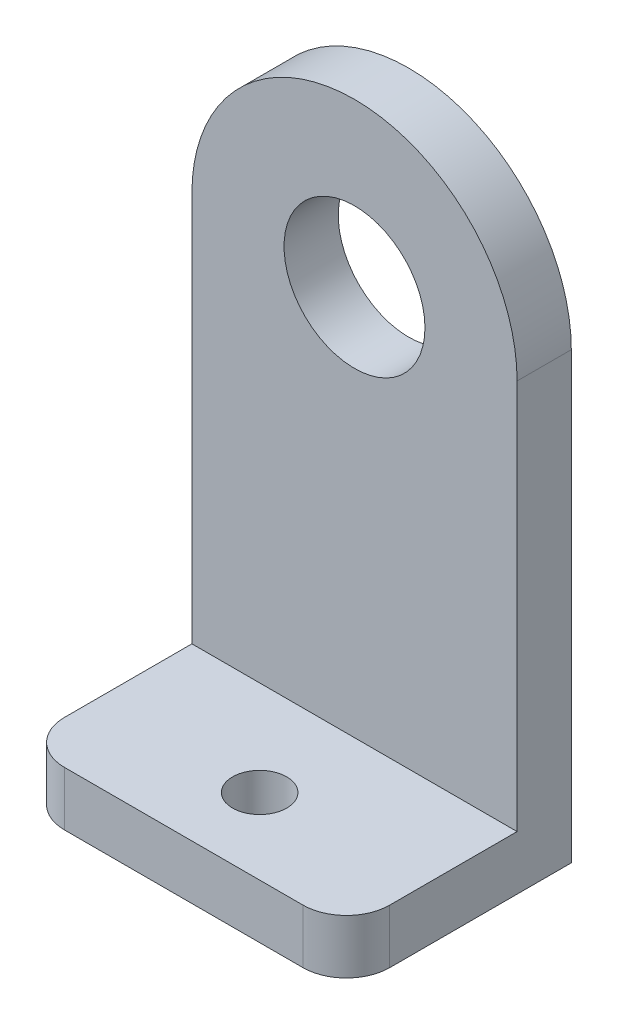
ISO-10303-21;
HEADER;
FILE_DESCRIPTION(('STEP AP214'),'2;1');
FILE_NAME('part.step','',(''),(''),'','','');
FILE_SCHEMA(('AUTOMOTIVE_DESIGN { 1 0 10303 214 1 1 1 1 }'));
ENDSEC;
DATA;
#1=APPLICATION_CONTEXT('core data for automotive mechanical design processes');
#2=APPLICATION_PROTOCOL_DEFINITION('international standard','automotive_design',2000,#1);
#3=PRODUCT_CONTEXT('',#1,'mechanical');
#4=PRODUCT('Part','Part','',(#3));
#5=PRODUCT_RELATED_PRODUCT_CATEGORY('part','',(#4));
#6=PRODUCT_DEFINITION_FORMATION('','',#4);
#7=PRODUCT_DEFINITION_CONTEXT('part definition',#1,'design');
#8=PRODUCT_DEFINITION('design','',#6,#7);
#9=PRODUCT_DEFINITION_SHAPE('','',#8);
#10=(LENGTH_UNIT() NAMED_UNIT(*) SI_UNIT(.MILLI.,.METRE.));
#11=(NAMED_UNIT(*) PLANE_ANGLE_UNIT() SI_UNIT($,.RADIAN.));
#12=(NAMED_UNIT(*) SI_UNIT($,.STERADIAN.) SOLID_ANGLE_UNIT());
#13=UNCERTAINTY_MEASURE_WITH_UNIT(LENGTH_MEASURE(1.E-05),#10,'distance_accuracy_value','');
#14=(GEOMETRIC_REPRESENTATION_CONTEXT(3) GLOBAL_UNCERTAINTY_ASSIGNED_CONTEXT((#13)) GLOBAL_UNIT_ASSIGNED_CONTEXT((#10,
#11,#12)) REPRESENTATION_CONTEXT('',''));
#15=CARTESIAN_POINT('',(0.,0.,0.));
#16=DIRECTION('',(0.,0.,1.));
#17=DIRECTION('',(1.,0.,0.));
#18=AXIS2_PLACEMENT_3D('',#15,#16,#17);
#19=CARTESIAN_POINT('',(0.,0.,6.35));
#20=DIRECTION('',(0.,0.,-1.));
#21=DIRECTION('',(-1.,0.,0.));
#22=AXIS2_PLACEMENT_3D('',#19,#20,#21);
#23=CYLINDRICAL_SURFACE('',#22,19.05);
#24=CARTESIAN_POINT('',(0.,0.,0.));
#25=DIRECTION('',(0.,0.,1.));
#26=DIRECTION('',(1.,0.,0.));
#27=AXIS2_PLACEMENT_3D('',#24,#25,#26);
#28=CIRCLE('',#27,19.05);
#29=CARTESIAN_POINT('',(19.05,0.,0.));
#30=VERTEX_POINT('',#29);
#31=CARTESIAN_POINT('',(-19.05,0.,0.));
#32=VERTEX_POINT('',#31);
#33=EDGE_CURVE('E116',#30,#32,#28,.T.);
#34=ORIENTED_EDGE('',*,*,#33,.T.);
#35=DIRECTION('',(0.,0.,-1.));
#36=VECTOR('',#35,1.);
#37=CARTESIAN_POINT('',(-19.05,0.,6.35));
#38=LINE('',#37,#36);
#39=CARTESIAN_POINT('',(-19.05,0.,6.35));
#40=VERTEX_POINT('',#39);
#41=EDGE_CURVE('E114',#40,#32,#38,.T.);
#42=ORIENTED_EDGE('',*,*,#41,.F.);
#43=CARTESIAN_POINT('',(0.,0.,6.35));
#44=DIRECTION('',(0.,0.,1.));
#45=DIRECTION('',(1.,0.,0.));
#46=AXIS2_PLACEMENT_3D('',#43,#44,#45);
#47=CIRCLE('',#46,19.05);
#48=CARTESIAN_POINT('',(19.05,0.,6.35));
#49=VERTEX_POINT('',#48);
#50=EDGE_CURVE('E146',#49,#40,#47,.T.);
#51=ORIENTED_EDGE('',*,*,#50,.F.);
#52=DIRECTION('',(0.,0.,-1.));
#53=VECTOR('',#52,1.);
#54=CARTESIAN_POINT('',(19.05,0.,6.35));
#55=LINE('',#54,#53);
#56=EDGE_CURVE('E156',#49,#30,#55,.T.);
#57=ORIENTED_EDGE('',*,*,#56,.T.);
#58=EDGE_LOOP('',(#34,#42,#51,#57));
#59=FACE_BOUND('',#58,.T.);
#60=ADVANCED_FACE('F40',(#59),#23,.T.);
#61=CARTESIAN_POINT('',(-19.05,0.,6.35));
#62=DIRECTION('',(-1.,0.,0.));
#63=DIRECTION('',(0.,-1.,0.));
#64=AXIS2_PLACEMENT_3D('',#61,#62,#63);
#65=PLANE('',#64);
#66=DIRECTION('',(0.,1.,0.));
#67=VECTOR('',#66,1.);
#68=CARTESIAN_POINT('',(-19.05,0.,0.));
#69=LINE('',#68,#67);
#70=CARTESIAN_POINT('',(-19.05,-52.07,0.));
#71=VERTEX_POINT('',#70);
#72=EDGE_CURVE('E106',#71,#32,#69,.T.);
#73=ORIENTED_EDGE('',*,*,#72,.F.);
#74=DIRECTION('',(0.,0.,-1.));
#75=VECTOR('',#74,1.);
#76=CARTESIAN_POINT('',(-19.05,-52.07,-20.0025));
#77=LINE('',#76,#75);
#78=CARTESIAN_POINT('',(-19.05,-52.07,21.2725));
#79=VERTEX_POINT('',#78);
#80=EDGE_CURVE('E110',#79,#71,#77,.T.);
#81=ORIENTED_EDGE('',*,*,#80,.F.);
#82=DIRECTION('',(0.,1.,0.));
#83=VECTOR('',#82,1.);
#84=CARTESIAN_POINT('',(-19.05,-45.72,21.2725));
#85=LINE('',#84,#83);
#86=CARTESIAN_POINT('',(-19.05,-45.72,21.2725));
#87=VERTEX_POINT('',#86);
#88=EDGE_CURVE('E163',#79,#87,#85,.T.);
#89=ORIENTED_EDGE('',*,*,#88,.T.);
#90=DIRECTION('',(0.,0.,-1.));
#91=VECTOR('',#90,1.);
#92=CARTESIAN_POINT('',(-19.05,-45.72,-17.4625));
#93=LINE('',#92,#91);
#94=CARTESIAN_POINT('',(-19.05,-45.72,6.35));
#95=VERTEX_POINT('',#94);
#96=EDGE_CURVE('E137',#87,#95,#93,.T.);
#97=ORIENTED_EDGE('',*,*,#96,.T.);
#98=DIRECTION('',(0.,1.,0.));
#99=VECTOR('',#98,1.);
#100=CARTESIAN_POINT('',(-19.05,0.,6.35));
#101=LINE('',#100,#99);
#102=EDGE_CURVE('E148',#95,#40,#101,.T.);
#103=ORIENTED_EDGE('',*,*,#102,.T.);
#104=ORIENTED_EDGE('',*,*,#41,.T.);
#105=EDGE_LOOP('',(#73,#81,#89,#97,#103,#104));
#106=FACE_BOUND('',#105,.T.);
#107=ADVANCED_FACE('F107',(#106),#65,.T.);
#108=CARTESIAN_POINT('',(0.,0.,6.35));
#109=DIRECTION('',(0.,0.,-1.));
#110=DIRECTION('',(-1.,0.,0.));
#111=AXIS2_PLACEMENT_3D('',#108,#109,#110);
#112=CYLINDRICAL_SURFACE('',#111,8.255);
#113=CARTESIAN_POINT('',(0.,0.,6.35));
#114=DIRECTION('',(0.,0.,1.));
#115=DIRECTION('',(1.,0.,0.));
#116=AXIS2_PLACEMENT_3D('',#113,#114,#115);
#117=CIRCLE('',#116,8.255);
#118=CARTESIAN_POINT('',(8.255,0.,6.35));
#119=VERTEX_POINT('',#118);
#120=EDGE_CURVE('E143',#119,#119,#117,.T.);
#121=ORIENTED_EDGE('',*,*,#120,.T.);
#122=EDGE_LOOP('',(#121));
#123=FACE_BOUND('',#122,.T.);
#124=CARTESIAN_POINT('',(0.,0.,0.));
#125=DIRECTION('',(0.,0.,1.));
#126=DIRECTION('',(1.,0.,0.));
#127=AXIS2_PLACEMENT_3D('',#124,#125,#126);
#128=CIRCLE('',#127,8.255);
#129=CARTESIAN_POINT('',(8.255,0.,0.));
#130=VERTEX_POINT('',#129);
#131=EDGE_CURVE('E142',#130,#130,#128,.T.);
#132=ORIENTED_EDGE('',*,*,#131,.F.);
#133=EDGE_LOOP('',(#132));
#134=FACE_BOUND('',#133,.T.);
#135=ADVANCED_FACE('F204',(#123,#134),#112,.F.);
#136=CARTESIAN_POINT('',(19.05,0.,6.35));
#137=DIRECTION('',(1.,0.,0.));
#138=DIRECTION('',(0.,1.,0.));
#139=AXIS2_PLACEMENT_3D('',#136,#137,#138);
#140=PLANE('',#139);
#141=DIRECTION('',(0.,0.,1.));
#142=VECTOR('',#141,1.);
#143=CARTESIAN_POINT('',(19.05,-52.07,26.3525));
#144=LINE('',#143,#142);
#145=CARTESIAN_POINT('',(19.05,-52.07,0.));
#146=VERTEX_POINT('',#145);
#147=CARTESIAN_POINT('',(19.05,-52.07,21.2725));
#148=VERTEX_POINT('',#147);
#149=EDGE_CURVE('E61',#146,#148,#144,.T.);
#150=ORIENTED_EDGE('',*,*,#149,.F.);
#151=DIRECTION('',(0.,-1.,0.));
#152=VECTOR('',#151,1.);
#153=CARTESIAN_POINT('',(19.05,0.,0.));
#154=LINE('',#153,#152);
#155=EDGE_CURVE('E55',#30,#146,#154,.T.);
#156=ORIENTED_EDGE('',*,*,#155,.F.);
#157=ORIENTED_EDGE('',*,*,#56,.F.);
#158=DIRECTION('',(0.,-1.,0.));
#159=VECTOR('',#158,1.);
#160=CARTESIAN_POINT('',(19.05,0.,6.35));
#161=LINE('',#160,#159);
#162=CARTESIAN_POINT('',(19.05,-45.72,6.35));
#163=VERTEX_POINT('',#162);
#164=EDGE_CURVE('E153',#49,#163,#161,.T.);
#165=ORIENTED_EDGE('',*,*,#164,.T.);
#166=DIRECTION('',(0.,0.,1.));
#167=VECTOR('',#166,1.);
#168=CARTESIAN_POINT('',(19.05,-45.72,-17.4625));
#169=LINE('',#168,#167);
#170=CARTESIAN_POINT('',(19.05,-45.72,21.2725));
#171=VERTEX_POINT('',#170);
#172=EDGE_CURVE('E139',#163,#171,#169,.T.);
#173=ORIENTED_EDGE('',*,*,#172,.T.);
#174=DIRECTION('',(0.,-1.,0.));
#175=VECTOR('',#174,1.);
#176=CARTESIAN_POINT('',(19.05,-52.07,21.2725));
#177=LINE('',#176,#175);
#178=EDGE_CURVE('E48',#171,#148,#177,.T.);
#179=ORIENTED_EDGE('',*,*,#178,.T.);
#180=EDGE_LOOP('',(#150,#156,#157,#165,#173,#179));
#181=FACE_BOUND('',#180,.T.);
#182=ADVANCED_FACE('F178',(#181),#140,.T.);
#183=CARTESIAN_POINT('',(0.,0.,6.35));
#184=DIRECTION('',(0.,0.,1.));
#185=DIRECTION('',(1.,0.,0.));
#186=AXIS2_PLACEMENT_3D('',#183,#184,#185);
#187=PLANE('',#186);
#188=ORIENTED_EDGE('',*,*,#120,.F.);
#189=EDGE_LOOP('',(#188));
#190=FACE_BOUND('',#189,.T.);
#191=ORIENTED_EDGE('',*,*,#50,.T.);
#192=ORIENTED_EDGE('',*,*,#102,.F.);
#193=DIRECTION('',(-1.,0.,0.));
#194=VECTOR('',#193,1.);
#195=CARTESIAN_POINT('',(0.,-45.72,6.35));
#196=LINE('',#195,#194);
#197=EDGE_CURVE('E150',#163,#95,#196,.T.);
#198=ORIENTED_EDGE('',*,*,#197,.F.);
#199=ORIENTED_EDGE('',*,*,#164,.F.);
#200=EDGE_LOOP('',(#191,#192,#198,#199));
#201=FACE_BOUND('',#200,.T.);
#202=ADVANCED_FACE('F196',(#190,#201),#187,.T.);
#203=CARTESIAN_POINT('',(0.,0.,0.));
#204=DIRECTION('',(0.,0.,1.));
#205=DIRECTION('',(1.,0.,0.));
#206=AXIS2_PLACEMENT_3D('',#203,#204,#205);
#207=PLANE('',#206);
#208=ORIENTED_EDGE('',*,*,#131,.T.);
#209=EDGE_LOOP('',(#208));
#210=FACE_BOUND('',#209,.T.);
#211=ORIENTED_EDGE('',*,*,#155,.T.);
#212=DIRECTION('',(1.,0.,0.));
#213=VECTOR('',#212,1.);
#214=CARTESIAN_POINT('',(0.,-52.07,0.));
#215=LINE('',#214,#213);
#216=EDGE_CURVE('E11',#71,#146,#215,.T.);
#217=ORIENTED_EDGE('',*,*,#216,.F.);
#218=ORIENTED_EDGE('',*,*,#72,.T.);
#219=ORIENTED_EDGE('',*,*,#33,.F.);
#220=EDGE_LOOP('',(#211,#217,#218,#219));
#221=FACE_BOUND('',#220,.T.);
#222=ADVANCED_FACE('F118',(#210,#221),#207,.F.);
#223=CARTESIAN_POINT('',(0.,-45.72,0.));
#224=DIRECTION('',(0.,-1.,0.));
#225=DIRECTION('',(0.,0.,-1.));
#226=AXIS2_PLACEMENT_3D('',#223,#224,#225);
#227=PLANE('',#226);
#228=CARTESIAN_POINT('',(0.,-45.72,17.4625));
#229=DIRECTION('',(0.,-1.,0.));
#230=DIRECTION('',(0.,0.,-1.));
#231=AXIS2_PLACEMENT_3D('',#228,#229,#230);
#232=CIRCLE('',#231,3.175);
#233=CARTESIAN_POINT('',(0.,-45.72,14.2875));
#234=VERTEX_POINT('',#233);
#235=EDGE_CURVE('E134',#234,#234,#232,.T.);
#236=ORIENTED_EDGE('',*,*,#235,.T.);
#237=EDGE_LOOP('',(#236));
#238=FACE_BOUND('',#237,.T.);
#239=ORIENTED_EDGE('',*,*,#96,.F.);
#240=CARTESIAN_POINT('',(-13.97,-45.72,21.2725));
#241=DIRECTION('',(0.,-1.,0.));
#242=DIRECTION('',(0.,0.,-1.));
#243=AXIS2_PLACEMENT_3D('',#240,#241,#242);
#244=CIRCLE('',#243,5.08);
#245=CARTESIAN_POINT('',(-13.97,-45.72,26.3525));
#246=VERTEX_POINT('',#245);
#247=EDGE_CURVE('E167',#87,#246,#244,.F.);
#248=ORIENTED_EDGE('',*,*,#247,.T.);
#249=DIRECTION('',(1.,0.,0.));
#250=VECTOR('',#249,1.);
#251=CARTESIAN_POINT('',(-19.05,-45.72,26.3525));
#252=LINE('',#251,#250);
#253=CARTESIAN_POINT('',(13.97,-45.72,26.3525));
#254=VERTEX_POINT('',#253);
#255=EDGE_CURVE('E131',#246,#254,#252,.T.);
#256=ORIENTED_EDGE('',*,*,#255,.T.);
#257=CARTESIAN_POINT('',(13.97,-45.72,21.2725));
#258=DIRECTION('',(0.,-1.,0.));
#259=DIRECTION('',(0.,0.,-1.));
#260=AXIS2_PLACEMENT_3D('',#257,#258,#259);
#261=CIRCLE('',#260,5.08);
#262=EDGE_CURVE('E165',#254,#171,#261,.F.);
#263=ORIENTED_EDGE('',*,*,#262,.T.);
#264=ORIENTED_EDGE('',*,*,#172,.F.);
#265=ORIENTED_EDGE('',*,*,#197,.T.);
#266=EDGE_LOOP('',(#239,#248,#256,#263,#264,#265));
#267=FACE_BOUND('',#266,.T.);
#268=ADVANCED_FACE('F193',(#238,#267),#227,.F.);
#269=CARTESIAN_POINT('',(0.,-48.895,17.4625));
#270=DIRECTION('',(0.,1.,0.));
#271=DIRECTION('',(0.,0.,1.));
#272=AXIS2_PLACEMENT_3D('',#269,#270,#271);
#273=CYLINDRICAL_SURFACE('',#272,3.175);
#274=ORIENTED_EDGE('',*,*,#235,.F.);
#275=EDGE_LOOP('',(#274));
#276=FACE_BOUND('',#275,.T.);
#277=CARTESIAN_POINT('',(0.,-52.07,17.4625));
#278=DIRECTION('',(0.,-1.,0.));
#279=DIRECTION('',(0.,0.,-1.));
#280=AXIS2_PLACEMENT_3D('',#277,#278,#279);
#281=CIRCLE('',#280,3.175);
#282=CARTESIAN_POINT('',(0.,-52.07,14.2875));
#283=VERTEX_POINT('',#282);
#284=EDGE_CURVE('E123',#283,#283,#281,.T.);
#285=ORIENTED_EDGE('',*,*,#284,.T.);
#286=EDGE_LOOP('',(#285));
#287=FACE_BOUND('',#286,.T.);
#288=ADVANCED_FACE('F220',(#276,#287),#273,.F.);
#289=CARTESIAN_POINT('',(0.,0.,26.3525));
#290=DIRECTION('',(0.,0.,-1.));
#291=DIRECTION('',(-1.,0.,0.));
#292=AXIS2_PLACEMENT_3D('',#289,#290,#291);
#293=PLANE('',#292);
#294=ORIENTED_EDGE('',*,*,#255,.F.);
#295=DIRECTION('',(0.,1.,0.));
#296=VECTOR('',#295,1.);
#297=CARTESIAN_POINT('',(-13.97,-52.07,26.3525));
#298=LINE('',#297,#296);
#299=CARTESIAN_POINT('',(-13.97,-52.07,26.3525));
#300=VERTEX_POINT('',#299);
#301=EDGE_CURVE('E171',#246,#300,#298,.F.);
#302=ORIENTED_EDGE('',*,*,#301,.T.);
#303=DIRECTION('',(-1.,0.,0.));
#304=VECTOR('',#303,1.);
#305=CARTESIAN_POINT('',(-19.05,-52.07,26.3525));
#306=LINE('',#305,#304);
#307=CARTESIAN_POINT('',(13.97,-52.07,26.3525));
#308=VERTEX_POINT('',#307);
#309=EDGE_CURVE('E125',#308,#300,#306,.T.);
#310=ORIENTED_EDGE('',*,*,#309,.F.);
#311=DIRECTION('',(0.,-1.,0.));
#312=VECTOR('',#311,1.);
#313=CARTESIAN_POINT('',(13.97,-45.72,26.3525));
#314=LINE('',#313,#312);
#315=EDGE_CURVE('E169',#308,#254,#314,.F.);
#316=ORIENTED_EDGE('',*,*,#315,.T.);
#317=EDGE_LOOP('',(#294,#302,#310,#316));
#318=FACE_BOUND('',#317,.T.);
#319=ADVANCED_FACE('F186',(#318),#293,.F.);
#320=CARTESIAN_POINT('',(0.,-52.07,0.));
#321=DIRECTION('',(0.,1.,0.));
#322=DIRECTION('',(0.,0.,1.));
#323=AXIS2_PLACEMENT_3D('',#320,#321,#322);
#324=PLANE('',#323);
#325=ORIENTED_EDGE('',*,*,#284,.F.);
#326=EDGE_LOOP('',(#325));
#327=FACE_BOUND('',#326,.T.);
#328=ORIENTED_EDGE('',*,*,#80,.T.);
#329=ORIENTED_EDGE('',*,*,#216,.T.);
#330=ORIENTED_EDGE('',*,*,#149,.T.);
#331=CARTESIAN_POINT('',(13.97,-52.07,21.2725));
#332=DIRECTION('',(0.,1.,0.));
#333=DIRECTION('',(0.,0.,1.));
#334=AXIS2_PLACEMENT_3D('',#331,#332,#333);
#335=CIRCLE('',#334,5.08);
#336=EDGE_CURVE('E173',#148,#308,#335,.F.);
#337=ORIENTED_EDGE('',*,*,#336,.T.);
#338=ORIENTED_EDGE('',*,*,#309,.T.);
#339=CARTESIAN_POINT('',(-13.97,-52.07,21.2725));
#340=DIRECTION('',(0.,1.,0.));
#341=DIRECTION('',(0.,0.,1.));
#342=AXIS2_PLACEMENT_3D('',#339,#340,#341);
#343=CIRCLE('',#342,5.08);
#344=EDGE_CURVE('E122',#300,#79,#343,.F.);
#345=ORIENTED_EDGE('',*,*,#344,.T.);
#346=EDGE_LOOP('',(#328,#329,#330,#337,#338,#345));
#347=FACE_BOUND('',#346,.T.);
#348=ADVANCED_FACE('F119',(#327,#347),#324,.F.);
#349=CARTESIAN_POINT('',(-13.97,0.,21.2725));
#350=DIRECTION('',(0.,-1.,0.));
#351=DIRECTION('',(1.,0.,0.));
#352=AXIS2_PLACEMENT_3D('',#349,#350,#351);
#353=CYLINDRICAL_SURFACE('',#352,5.08);
#354=ORIENTED_EDGE('',*,*,#344,.F.);
#355=ORIENTED_EDGE('',*,*,#301,.F.);
#356=ORIENTED_EDGE('',*,*,#247,.F.);
#357=ORIENTED_EDGE('',*,*,#88,.F.);
#358=EDGE_LOOP('',(#354,#355,#356,#357));
#359=FACE_BOUND('',#358,.T.);
#360=ADVANCED_FACE('F189',(#359),#353,.T.);
#361=CARTESIAN_POINT('',(13.97,0.,21.2725));
#362=DIRECTION('',(0.,1.,0.));
#363=DIRECTION('',(-1.,0.,0.));
#364=AXIS2_PLACEMENT_3D('',#361,#362,#363);
#365=CYLINDRICAL_SURFACE('',#364,5.08);
#366=ORIENTED_EDGE('',*,*,#262,.F.);
#367=ORIENTED_EDGE('',*,*,#315,.F.);
#368=ORIENTED_EDGE('',*,*,#336,.F.);
#369=ORIENTED_EDGE('',*,*,#178,.F.);
#370=EDGE_LOOP('',(#366,#367,#368,#369));
#371=FACE_BOUND('',#370,.T.);
#372=ADVANCED_FACE('F42',(#371),#365,.T.);
#373=CLOSED_SHELL('',(#60,#107,#135,#182,#202,#222,#268,#288,#319,#348,#360,#372));
#374=MANIFOLD_SOLID_BREP('B2',#373);
#375=ADVANCED_BREP_SHAPE_REPRESENTATION('',(#18,#374),#14);
#376=SHAPE_DEFINITION_REPRESENTATION(#9,#375);
ENDSEC;
END-ISO-10303-21;
